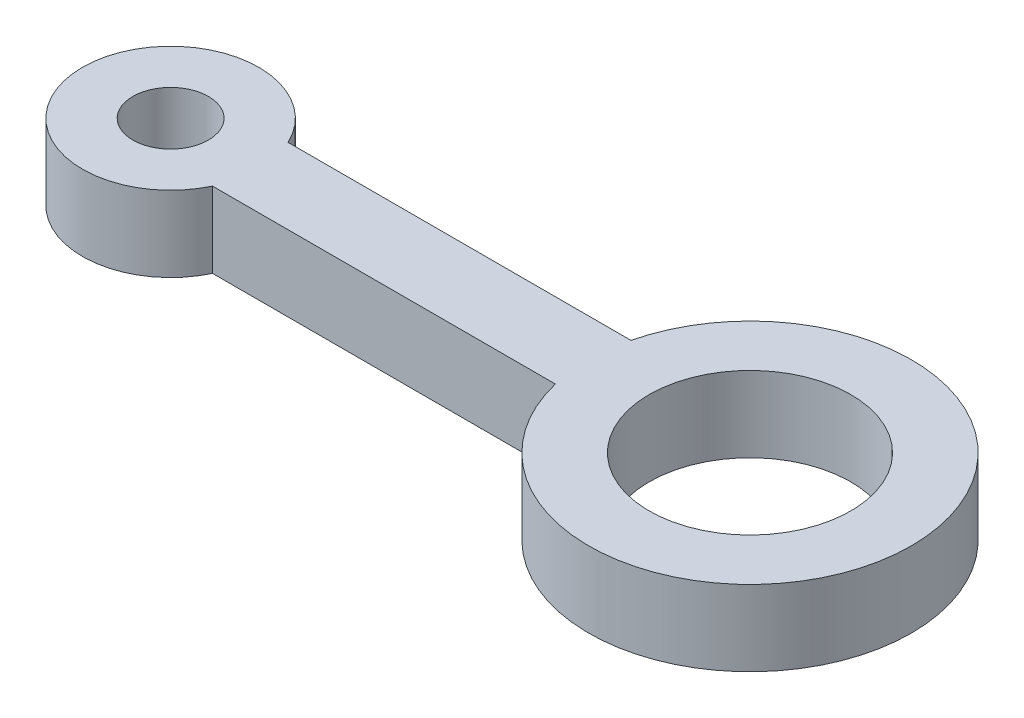
ISO-10303-21;
HEADER;
FILE_DESCRIPTION(('STEP AP214'),'2;1');
FILE_NAME('part.step','',(''),(''),'','','');
FILE_SCHEMA(('AUTOMOTIVE_DESIGN { 1 0 10303 214 1 1 1 1 }'));
ENDSEC;
DATA;
#1=APPLICATION_CONTEXT('core data for automotive mechanical design processes');
#2=APPLICATION_PROTOCOL_DEFINITION('international standard','automotive_design',2000,#1);
#3=PRODUCT_CONTEXT('',#1,'mechanical');
#4=PRODUCT('Part','Part','',(#3));
#5=PRODUCT_RELATED_PRODUCT_CATEGORY('part','',(#4));
#6=PRODUCT_DEFINITION_FORMATION('','',#4);
#7=PRODUCT_DEFINITION_CONTEXT('part definition',#1,'design');
#8=PRODUCT_DEFINITION('design','',#6,#7);
#9=PRODUCT_DEFINITION_SHAPE('','',#8);
#10=(LENGTH_UNIT() NAMED_UNIT(*) SI_UNIT(.MILLI.,.METRE.));
#11=(NAMED_UNIT(*) PLANE_ANGLE_UNIT() SI_UNIT($,.RADIAN.));
#12=(NAMED_UNIT(*) SI_UNIT($,.STERADIAN.) SOLID_ANGLE_UNIT());
#13=UNCERTAINTY_MEASURE_WITH_UNIT(LENGTH_MEASURE(1.E-05),#10,'distance_accuracy_value','');
#14=(GEOMETRIC_REPRESENTATION_CONTEXT(3) GLOBAL_UNCERTAINTY_ASSIGNED_CONTEXT((#13)) GLOBAL_UNIT_ASSIGNED_CONTEXT((#10,
#11,#12)) REPRESENTATION_CONTEXT('',''));
#15=CARTESIAN_POINT('',(0.,0.,0.));
#16=DIRECTION('',(0.,0.,1.));
#17=DIRECTION('',(1.,0.,0.));
#18=AXIS2_PLACEMENT_3D('',#15,#16,#17);
#19=CARTESIAN_POINT('',(-10.0420068761447,0.,0.));
#20=DIRECTION('',(0.,1.,0.));
#21=DIRECTION('',(1.,0.,0.));
#22=AXIS2_PLACEMENT_3D('',#19,#20,#21);
#23=PLANE('',#22);
#24=CARTESIAN_POINT('',(-22.9840137522893,0.,0.));
#25=DIRECTION('',(0.,-1.,0.));
#26=DIRECTION('',(1.,0.,0.));
#27=AXIS2_PLACEMENT_3D('',#24,#25,#26);
#28=CIRCLE('',#27,1.5);
#29=CARTESIAN_POINT('',(-24.4840137522893,0.,0.));
#30=VERTEX_POINT('',#29);
#31=EDGE_CURVE('E93',#30,#30,#28,.T.);
#32=ORIENTED_EDGE('',*,*,#31,.F.);
#33=EDGE_LOOP('',(#32));
#34=FACE_BOUND('',#33,.T.);
#35=CARTESIAN_POINT('',(0.,0.,0.));
#36=DIRECTION('',(0.,-1.,0.));
#37=DIRECTION('',(1.,0.,0.));
#38=AXIS2_PLACEMENT_3D('',#35,#36,#37);
#39=CIRCLE('',#38,4.);
#40=CARTESIAN_POINT('',(-4.,0.,0.));
#41=VERTEX_POINT('',#40);
#42=EDGE_CURVE('E106',#41,#41,#39,.T.);
#43=ORIENTED_EDGE('',*,*,#42,.F.);
#44=EDGE_LOOP('',(#43));
#45=FACE_BOUND('',#44,.T.);
#46=CARTESIAN_POINT('',(0.,0.,0.));
#47=DIRECTION('',(0.,1.,0.));
#48=DIRECTION('',(1.,0.,0.));
#49=AXIS2_PLACEMENT_3D('',#46,#47,#48);
#50=CIRCLE('',#49,6.4);
#51=CARTESIAN_POINT('',(-6.22173609212091,0.,1.5));
#52=VERTEX_POINT('',#51);
#53=CARTESIAN_POINT('',(-6.22173609212092,0.,-1.5));
#54=VERTEX_POINT('',#53);
#55=EDGE_CURVE('E11',#52,#54,#50,.T.);
#56=ORIENTED_EDGE('',*,*,#55,.F.);
#57=DIRECTION('',(-1.,0.,0.));
#58=VECTOR('',#57,1.);
#59=CARTESIAN_POINT('',(-6.22173609212091,0.,1.5));
#60=LINE('',#59,#58);
#61=CARTESIAN_POINT('',(-19.8217360921209,0.,1.5));
#62=VERTEX_POINT('',#61);
#63=EDGE_CURVE('E123',#52,#62,#60,.T.);
#64=ORIENTED_EDGE('',*,*,#63,.T.);
#65=CARTESIAN_POINT('',(-22.9840137522893,0.,0.));
#66=DIRECTION('',(0.,1.,0.));
#67=DIRECTION('',(1.,0.,0.));
#68=AXIS2_PLACEMENT_3D('',#65,#66,#67);
#69=CIRCLE('',#68,3.5);
#70=CARTESIAN_POINT('',(-19.8217360921209,0.,-1.5));
#71=VERTEX_POINT('',#70);
#72=EDGE_CURVE('E234',#71,#62,#69,.T.);
#73=ORIENTED_EDGE('',*,*,#72,.F.);
#74=DIRECTION('',(-1.,0.,0.));
#75=VECTOR('',#74,1.);
#76=CARTESIAN_POINT('',(-6.22173609212092,0.,-1.5));
#77=LINE('',#76,#75);
#78=EDGE_CURVE('E133',#54,#71,#77,.T.);
#79=ORIENTED_EDGE('',*,*,#78,.F.);
#80=EDGE_LOOP('',(#56,#64,#73,#79));
#81=FACE_BOUND('',#80,.T.);
#82=ADVANCED_FACE('F19',(#34,#45,#81),#23,.F.);
#83=CARTESIAN_POINT('',(0.,0.,0.));
#84=DIRECTION('',(0.,1.,0.));
#85=DIRECTION('',(1.,0.,0.));
#86=AXIS2_PLACEMENT_3D('',#83,#84,#85);
#87=CYLINDRICAL_SURFACE('',#86,6.4);
#88=ORIENTED_EDGE('',*,*,#55,.T.);
#89=DIRECTION('',(0.,1.,0.));
#90=VECTOR('',#89,1.);
#91=CARTESIAN_POINT('',(-6.22173609212092,0.,-1.5));
#92=LINE('',#91,#90);
#93=CARTESIAN_POINT('',(-6.22173609212092,3.,-1.5));
#94=VERTEX_POINT('',#93);
#95=EDGE_CURVE('E31',#54,#94,#92,.T.);
#96=ORIENTED_EDGE('',*,*,#95,.T.);
#97=CARTESIAN_POINT('',(0.,3.,0.));
#98=DIRECTION('',(0.,1.,0.));
#99=DIRECTION('',(1.,0.,0.));
#100=AXIS2_PLACEMENT_3D('',#97,#98,#99);
#101=CIRCLE('',#100,6.4);
#102=CARTESIAN_POINT('',(-6.22173609212091,3.,1.5));
#103=VERTEX_POINT('',#102);
#104=EDGE_CURVE('E111',#103,#94,#101,.T.);
#105=ORIENTED_EDGE('',*,*,#104,.F.);
#106=DIRECTION('',(0.,1.,0.));
#107=VECTOR('',#106,1.);
#108=CARTESIAN_POINT('',(-6.22173609212091,0.,1.5));
#109=LINE('',#108,#107);
#110=EDGE_CURVE('E156',#52,#103,#109,.T.);
#111=ORIENTED_EDGE('',*,*,#110,.F.);
#112=EDGE_LOOP('',(#88,#96,#105,#111));
#113=FACE_BOUND('',#112,.T.);
#114=ADVANCED_FACE('F21',(#113),#87,.T.);
#115=CARTESIAN_POINT('',(-6.22173609212092,0.,-1.5));
#116=DIRECTION('',(0.,0.,-1.));
#117=DIRECTION('',(0.,-1.,0.));
#118=AXIS2_PLACEMENT_3D('',#115,#116,#117);
#119=PLANE('',#118);
#120=ORIENTED_EDGE('',*,*,#78,.T.);
#121=DIRECTION('',(0.,1.,0.));
#122=VECTOR('',#121,1.);
#123=CARTESIAN_POINT('',(-19.8217360921209,0.,-1.5));
#124=LINE('',#123,#122);
#125=CARTESIAN_POINT('',(-19.8217360921209,3.,-1.5));
#126=VERTEX_POINT('',#125);
#127=EDGE_CURVE('E23',#71,#126,#124,.T.);
#128=ORIENTED_EDGE('',*,*,#127,.T.);
#129=DIRECTION('',(-1.,0.,0.));
#130=VECTOR('',#129,1.);
#131=CARTESIAN_POINT('',(-6.22173609212092,3.,-1.5));
#132=LINE('',#131,#130);
#133=EDGE_CURVE('E124',#94,#126,#132,.T.);
#134=ORIENTED_EDGE('',*,*,#133,.F.);
#135=ORIENTED_EDGE('',*,*,#95,.F.);
#136=EDGE_LOOP('',(#120,#128,#134,#135));
#137=FACE_BOUND('',#136,.T.);
#138=ADVANCED_FACE('F261',(#137),#119,.T.);
#139=CARTESIAN_POINT('',(-22.9840137522893,0.,0.));
#140=DIRECTION('',(0.,1.,0.));
#141=DIRECTION('',(-1.,0.,0.));
#142=AXIS2_PLACEMENT_3D('',#139,#140,#141);
#143=CYLINDRICAL_SURFACE('',#142,3.5);
#144=ORIENTED_EDGE('',*,*,#72,.T.);
#145=DIRECTION('',(0.,1.,0.));
#146=VECTOR('',#145,1.);
#147=CARTESIAN_POINT('',(-19.8217360921209,0.,1.5));
#148=LINE('',#147,#146);
#149=CARTESIAN_POINT('',(-19.8217360921209,3.,1.5));
#150=VERTEX_POINT('',#149);
#151=EDGE_CURVE('E147',#62,#150,#148,.T.);
#152=ORIENTED_EDGE('',*,*,#151,.T.);
#153=CARTESIAN_POINT('',(-22.9840137522893,3.,0.));
#154=DIRECTION('',(0.,1.,0.));
#155=DIRECTION('',(1.,0.,0.));
#156=AXIS2_PLACEMENT_3D('',#153,#154,#155);
#157=CIRCLE('',#156,3.5);
#158=EDGE_CURVE('E142',#126,#150,#157,.T.);
#159=ORIENTED_EDGE('',*,*,#158,.F.);
#160=ORIENTED_EDGE('',*,*,#127,.F.);
#161=EDGE_LOOP('',(#144,#152,#159,#160));
#162=FACE_BOUND('',#161,.T.);
#163=ADVANCED_FACE('F268',(#162),#143,.T.);
#164=CARTESIAN_POINT('',(-19.8217360921209,0.,1.5));
#165=DIRECTION('',(0.,0.,1.));
#166=DIRECTION('',(1.,0.,0.));
#167=AXIS2_PLACEMENT_3D('',#164,#165,#166);
#168=PLANE('',#167);
#169=ORIENTED_EDGE('',*,*,#63,.F.);
#170=ORIENTED_EDGE('',*,*,#110,.T.);
#171=DIRECTION('',(1.,0.,0.));
#172=VECTOR('',#171,1.);
#173=CARTESIAN_POINT('',(-6.22173609212091,3.,1.5));
#174=LINE('',#173,#172);
#175=EDGE_CURVE('E132',#150,#103,#174,.T.);
#176=ORIENTED_EDGE('',*,*,#175,.F.);
#177=ORIENTED_EDGE('',*,*,#151,.F.);
#178=EDGE_LOOP('',(#169,#170,#176,#177));
#179=FACE_BOUND('',#178,.T.);
#180=ADVANCED_FACE('F275',(#179),#168,.T.);
#181=CARTESIAN_POINT('',(0.,0.,0.));
#182=DIRECTION('',(0.,1.,0.));
#183=DIRECTION('',(1.,0.,0.));
#184=AXIS2_PLACEMENT_3D('',#181,#182,#183);
#185=CYLINDRICAL_SURFACE('',#184,4.);
#186=CARTESIAN_POINT('',(0.,3.,0.));
#187=DIRECTION('',(0.,-1.,0.));
#188=DIRECTION('',(1.,0.,0.));
#189=AXIS2_PLACEMENT_3D('',#186,#187,#188);
#190=CIRCLE('',#189,4.);
#191=CARTESIAN_POINT('',(-4.,3.,0.));
#192=VERTEX_POINT('',#191);
#193=EDGE_CURVE('E127',#192,#192,#190,.T.);
#194=ORIENTED_EDGE('',*,*,#193,.F.);
#195=DIRECTION('',(0.,-1.,0.));
#196=VECTOR('',#195,1.);
#197=CARTESIAN_POINT('',(-4.,0.,0.));
#198=LINE('',#197,#196);
#199=EDGE_CURVE('E100',#192,#41,#198,.T.);
#200=ORIENTED_EDGE('',*,*,#199,.T.);
#201=ORIENTED_EDGE('',*,*,#42,.T.);
#202=ORIENTED_EDGE('',*,*,#199,.F.);
#203=EDGE_LOOP('',(#194,#200,#201,#202));
#204=FACE_BOUND('',#203,.T.);
#205=ADVANCED_FACE('F284',(#204),#185,.F.);
#206=CARTESIAN_POINT('',(-22.9840137522893,0.,0.));
#207=DIRECTION('',(0.,1.,0.));
#208=DIRECTION('',(1.,0.,0.));
#209=AXIS2_PLACEMENT_3D('',#206,#207,#208);
#210=CYLINDRICAL_SURFACE('',#209,1.5);
#211=CARTESIAN_POINT('',(-22.9840137522893,3.,0.));
#212=DIRECTION('',(0.,-1.,0.));
#213=DIRECTION('',(1.,0.,0.));
#214=AXIS2_PLACEMENT_3D('',#211,#212,#213);
#215=CIRCLE('',#214,1.5);
#216=CARTESIAN_POINT('',(-24.4840137522893,3.,0.));
#217=VERTEX_POINT('',#216);
#218=EDGE_CURVE('E108',#217,#217,#215,.T.);
#219=ORIENTED_EDGE('',*,*,#218,.F.);
#220=DIRECTION('',(0.,-1.,0.));
#221=VECTOR('',#220,1.);
#222=CARTESIAN_POINT('',(-24.4840137522893,0.,0.));
#223=LINE('',#222,#221);
#224=EDGE_CURVE('E96',#217,#30,#223,.T.);
#225=ORIENTED_EDGE('',*,*,#224,.T.);
#226=ORIENTED_EDGE('',*,*,#31,.T.);
#227=ORIENTED_EDGE('',*,*,#224,.F.);
#228=EDGE_LOOP('',(#219,#225,#226,#227));
#229=FACE_BOUND('',#228,.T.);
#230=ADVANCED_FACE('F95',(#229),#210,.F.);
#231=CARTESIAN_POINT('',(-10.0420068761447,3.,0.));
#232=DIRECTION('',(0.,1.,0.));
#233=DIRECTION('',(1.,0.,0.));
#234=AXIS2_PLACEMENT_3D('',#231,#232,#233);
#235=PLANE('',#234);
#236=ORIENTED_EDGE('',*,*,#218,.T.);
#237=EDGE_LOOP('',(#236));
#238=FACE_BOUND('',#237,.T.);
#239=ORIENTED_EDGE('',*,*,#193,.T.);
#240=EDGE_LOOP('',(#239));
#241=FACE_BOUND('',#240,.T.);
#242=ORIENTED_EDGE('',*,*,#104,.T.);
#243=ORIENTED_EDGE('',*,*,#133,.T.);
#244=ORIENTED_EDGE('',*,*,#158,.T.);
#245=ORIENTED_EDGE('',*,*,#175,.T.);
#246=EDGE_LOOP('',(#242,#243,#244,#245));
#247=FACE_BOUND('',#246,.T.);
#248=ADVANCED_FACE('F165',(#238,#241,#247),#235,.T.);
#249=CLOSED_SHELL('',(#82,#114,#138,#163,#180,#205,#230,#248));
#250=MANIFOLD_SOLID_BREP('B1',#249);
#251=ADVANCED_BREP_SHAPE_REPRESENTATION('',(#18,#250),#14);
#252=SHAPE_DEFINITION_REPRESENTATION(#9,#251);
ENDSEC;
END-ISO-10303-21;
